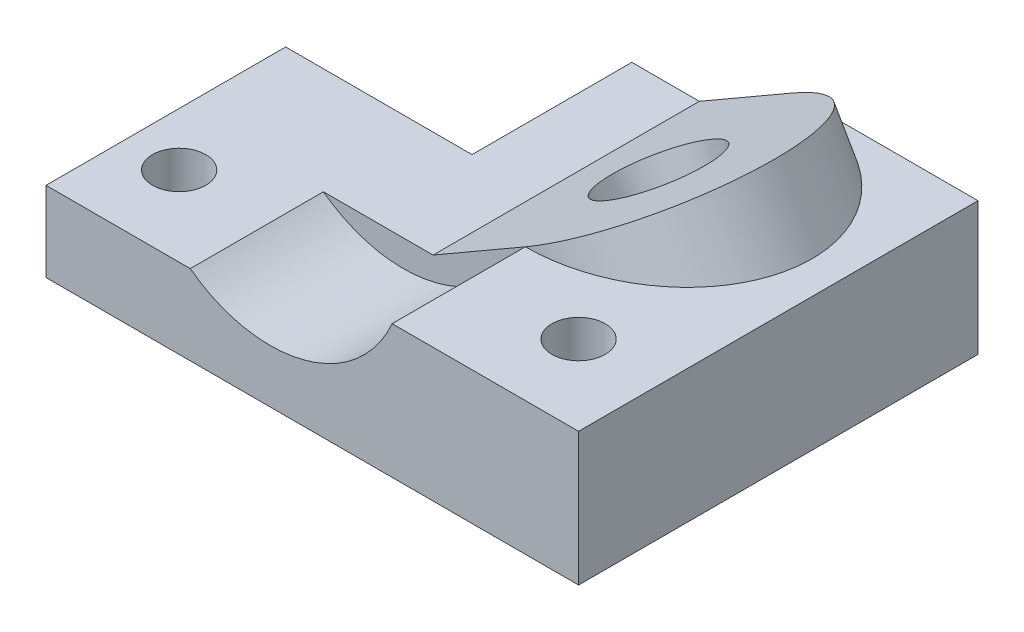
ISO-10303-21;
HEADER;
FILE_DESCRIPTION(('STEP AP214'),'2;1');
FILE_NAME('part.step','',(''),(''),'','','');
FILE_SCHEMA(('AUTOMOTIVE_DESIGN { 1 0 10303 214 1 1 1 1 }'));
ENDSEC;
DATA;
#1=APPLICATION_CONTEXT('core data for automotive mechanical design processes');
#2=APPLICATION_PROTOCOL_DEFINITION('international standard','automotive_design',2000,#1);
#3=PRODUCT_CONTEXT('',#1,'mechanical');
#4=PRODUCT('Part','Part','',(#3));
#5=PRODUCT_RELATED_PRODUCT_CATEGORY('part','',(#4));
#6=PRODUCT_DEFINITION_FORMATION('','',#4);
#7=PRODUCT_DEFINITION_CONTEXT('part definition',#1,'design');
#8=PRODUCT_DEFINITION('design','',#6,#7);
#9=PRODUCT_DEFINITION_SHAPE('','',#8);
#10=(LENGTH_UNIT() NAMED_UNIT(*) SI_UNIT(.MILLI.,.METRE.));
#11=(NAMED_UNIT(*) PLANE_ANGLE_UNIT() SI_UNIT($,.RADIAN.));
#12=(NAMED_UNIT(*) SI_UNIT($,.STERADIAN.) SOLID_ANGLE_UNIT());
#13=UNCERTAINTY_MEASURE_WITH_UNIT(LENGTH_MEASURE(1.E-05),#10,'distance_accuracy_value','');
#14=(GEOMETRIC_REPRESENTATION_CONTEXT(3) GLOBAL_UNCERTAINTY_ASSIGNED_CONTEXT((#13)) GLOBAL_UNIT_ASSIGNED_CONTEXT((#10,
#11,#12)) REPRESENTATION_CONTEXT('',''));
#15=CARTESIAN_POINT('',(0.,0.,0.));
#16=DIRECTION('',(0.,0.,1.));
#17=DIRECTION('',(1.,0.,0.));
#18=AXIS2_PLACEMENT_3D('',#15,#16,#17);
#19=CARTESIAN_POINT('',(0.,15.,0.));
#20=DIRECTION('',(0.,1.,0.));
#21=DIRECTION('',(0.,0.,1.));
#22=AXIS2_PLACEMENT_3D('',#19,#20,#21);
#23=PLANE('',#22);
#24=CARTESIAN_POINT('',(-90.,15.,-15.));
#25=DIRECTION('',(0.,1.,0.));
#26=DIRECTION('',(0.,0.,1.));
#27=AXIS2_PLACEMENT_3D('',#24,#25,#26);
#28=CIRCLE('',#27,5.);
#29=CARTESIAN_POINT('',(-90.,15.,-9.99999999999999));
#30=VERTEX_POINT('',#29);
#31=EDGE_CURVE('E179',#30,#30,#28,.T.);
#32=ORIENTED_EDGE('',*,*,#31,.F.);
#33=EDGE_LOOP('',(#32));
#34=FACE_BOUND('',#33,.T.);
#35=DIRECTION('',(-1.,0.,0.));
#36=VECTOR('',#35,1.);
#37=CARTESIAN_POINT('',(0.,15.,-25.));
#38=LINE('',#37,#36);
#39=CARTESIAN_POINT('',(-52.3205080756887,15.,-25.));
#40=VERTEX_POINT('',#39);
#41=CARTESIAN_POINT('',(-72.9128784747792,15.,-25.));
#42=VERTEX_POINT('',#41);
#43=EDGE_CURVE('E149',#40,#42,#38,.T.);
#44=ORIENTED_EDGE('',*,*,#43,.F.);
#45=DIRECTION('',(0.,0.,-1.));
#46=VECTOR('',#45,1.);
#47=CARTESIAN_POINT('',(-52.3205080756887,15.,-25.));
#48=LINE('',#47,#46);
#49=CARTESIAN_POINT('',(-52.3205080756887,15.,-75.));
#50=VERTEX_POINT('',#49);
#51=EDGE_CURVE('E62',#40,#50,#48,.T.);
#52=ORIENTED_EDGE('',*,*,#51,.T.);
#53=DIRECTION('',(-1.,0.,0.));
#54=VECTOR('',#53,1.);
#55=CARTESIAN_POINT('',(0.,15.,-75.));
#56=LINE('',#55,#54);
#57=CARTESIAN_POINT('',(-65.,15.,-75.));
#58=VERTEX_POINT('',#57);
#59=EDGE_CURVE('E194',#50,#58,#56,.T.);
#60=ORIENTED_EDGE('',*,*,#59,.T.);
#61=DIRECTION('',(0.,0.,1.));
#62=VECTOR('',#61,1.);
#63=CARTESIAN_POINT('',(-65.,15.,0.));
#64=LINE('',#63,#62);
#65=CARTESIAN_POINT('',(-65.,15.,-45.));
#66=VERTEX_POINT('',#65);
#67=EDGE_CURVE('E197',#58,#66,#64,.T.);
#68=ORIENTED_EDGE('',*,*,#67,.T.);
#69=DIRECTION('',(-1.,0.,0.));
#70=VECTOR('',#69,1.);
#71=CARTESIAN_POINT('',(0.,15.,-45.));
#72=LINE('',#71,#70);
#73=CARTESIAN_POINT('',(-100.,15.,-45.));
#74=VERTEX_POINT('',#73);
#75=EDGE_CURVE('E201',#66,#74,#72,.T.);
#76=ORIENTED_EDGE('',*,*,#75,.T.);
#77=DIRECTION('',(0.,0.,-1.));
#78=VECTOR('',#77,1.);
#79=CARTESIAN_POINT('',(-100.,15.,0.));
#80=LINE('',#79,#78);
#81=CARTESIAN_POINT('',(-100.,15.,0.));
#82=VERTEX_POINT('',#81);
#83=EDGE_CURVE('E204',#82,#74,#80,.T.);
#84=ORIENTED_EDGE('',*,*,#83,.F.);
#85=DIRECTION('',(-1.,0.,0.));
#86=VECTOR('',#85,1.);
#87=CARTESIAN_POINT('',(0.,15.,0.));
#88=LINE('',#87,#86);
#89=CARTESIAN_POINT('',(-72.9128784747792,15.,0.));
#90=VERTEX_POINT('',#89);
#91=EDGE_CURVE('E208',#90,#82,#88,.T.);
#92=ORIENTED_EDGE('',*,*,#91,.F.);
#93=DIRECTION('',(0.,0.,1.));
#94=VECTOR('',#93,1.);
#95=CARTESIAN_POINT('',(-72.9128784747792,15.,-25.));
#96=LINE('',#95,#94);
#97=EDGE_CURVE('E188',#42,#90,#96,.T.);
#98=ORIENTED_EDGE('',*,*,#97,.F.);
#99=EDGE_LOOP('',(#44,#52,#60,#68,#76,#84,#92,#98));
#100=FACE_BOUND('',#99,.T.);
#101=ADVANCED_FACE('F45',(#34,#100),#23,.T.);
#102=CARTESIAN_POINT('',(0.,25.,0.));
#103=DIRECTION('',(0.,0.,1.));
#104=DIRECTION('',(1.,0.,0.));
#105=AXIS2_PLACEMENT_3D('',#102,#103,#104);
#106=PLANE('',#105);
#107=DIRECTION('',(-1.,0.,0.));
#108=VECTOR('',#107,1.);
#109=CARTESIAN_POINT('',(0.,25.,0.));
#110=LINE('',#109,#108);
#111=CARTESIAN_POINT('',(0.,25.,0.));
#112=VERTEX_POINT('',#111);
#113=CARTESIAN_POINT('',(-35.,25.,0.));
#114=VERTEX_POINT('',#113);
#115=EDGE_CURVE('E238',#112,#114,#110,.T.);
#116=ORIENTED_EDGE('',*,*,#115,.T.);
#117=CARTESIAN_POINT('',(-57.9128784747792,35.,0.));
#118=DIRECTION('',(0.,0.,1.));
#119=DIRECTION('',(1.,0.,0.));
#120=AXIS2_PLACEMENT_3D('',#117,#118,#119);
#121=CIRCLE('',#120,25.);
#122=EDGE_CURVE('E91',#114,#90,#121,.F.);
#123=ORIENTED_EDGE('',*,*,#122,.T.);
#124=ORIENTED_EDGE('',*,*,#91,.T.);
#125=DIRECTION('',(0.,-1.,0.));
#126=VECTOR('',#125,1.);
#127=CARTESIAN_POINT('',(-100.,15.,0.));
#128=LINE('',#127,#126);
#129=CARTESIAN_POINT('',(-100.,0.,0.));
#130=VERTEX_POINT('',#129);
#131=EDGE_CURVE('E211',#82,#130,#128,.T.);
#132=ORIENTED_EDGE('',*,*,#131,.T.);
#133=DIRECTION('',(-1.,0.,0.));
#134=VECTOR('',#133,1.);
#135=CARTESIAN_POINT('',(0.,0.,0.));
#136=LINE('',#135,#134);
#137=CARTESIAN_POINT('',(0.,0.,0.));
#138=VERTEX_POINT('',#137);
#139=EDGE_CURVE('E245',#138,#130,#136,.T.);
#140=ORIENTED_EDGE('',*,*,#139,.F.);
#141=DIRECTION('',(0.,-1.,0.));
#142=VECTOR('',#141,1.);
#143=CARTESIAN_POINT('',(0.,25.,0.));
#144=LINE('',#143,#142);
#145=EDGE_CURVE('E11',#112,#138,#144,.T.);
#146=ORIENTED_EDGE('',*,*,#145,.F.);
#147=EDGE_LOOP('',(#116,#123,#124,#132,#140,#146));
#148=FACE_BOUND('',#147,.T.);
#149=ADVANCED_FACE('F272',(#148),#106,.T.);
#150=CARTESIAN_POINT('',(0.,25.,-75.));
#151=DIRECTION('',(0.,0.,1.));
#152=DIRECTION('',(1.,0.,0.));
#153=AXIS2_PLACEMENT_3D('',#150,#151,#152);
#154=PLANE('',#153);
#155=DIRECTION('',(-1.,0.,0.));
#156=VECTOR('',#155,1.);
#157=CARTESIAN_POINT('',(0.,0.,-75.));
#158=LINE('',#157,#156);
#159=CARTESIAN_POINT('',(0.,0.,-75.));
#160=VERTEX_POINT('',#159);
#161=CARTESIAN_POINT('',(-65.,0.,-75.));
#162=VERTEX_POINT('',#161);
#163=EDGE_CURVE('E235',#160,#162,#158,.T.);
#164=ORIENTED_EDGE('',*,*,#163,.T.);
#165=DIRECTION('',(0.,-1.,0.));
#166=VECTOR('',#165,1.);
#167=CARTESIAN_POINT('',(-65.,15.,-75.));
#168=LINE('',#167,#166);
#169=EDGE_CURVE('E231',#58,#162,#168,.T.);
#170=ORIENTED_EDGE('',*,*,#169,.F.);
#171=ORIENTED_EDGE('',*,*,#59,.F.);
#172=DIRECTION('',(-0.866025403784438,-0.500000000000001,0.));
#173=VECTOR('',#172,1.);
#174=CARTESIAN_POINT('',(-35.,25.,-75.));
#175=LINE('',#174,#173);
#176=CARTESIAN_POINT('',(-35.,25.,-75.));
#177=VERTEX_POINT('',#176);
#178=EDGE_CURVE('E146',#177,#50,#175,.T.);
#179=ORIENTED_EDGE('',*,*,#178,.F.);
#180=DIRECTION('',(-1.,0.,0.));
#181=VECTOR('',#180,1.);
#182=CARTESIAN_POINT('',(0.,25.,-75.));
#183=LINE('',#182,#181);
#184=CARTESIAN_POINT('',(0.,25.,-75.));
#185=VERTEX_POINT('',#184);
#186=EDGE_CURVE('E157',#185,#177,#183,.T.);
#187=ORIENTED_EDGE('',*,*,#186,.F.);
#188=DIRECTION('',(0.,-1.,0.));
#189=VECTOR('',#188,1.);
#190=CARTESIAN_POINT('',(0.,25.,-75.));
#191=LINE('',#190,#189);
#192=EDGE_CURVE('E55',#185,#160,#191,.T.);
#193=ORIENTED_EDGE('',*,*,#192,.T.);
#194=EDGE_LOOP('',(#164,#170,#171,#179,#187,#193));
#195=FACE_BOUND('',#194,.T.);
#196=ADVANCED_FACE('F47',(#195),#154,.F.);
#197=CARTESIAN_POINT('',(0.,25.,0.));
#198=DIRECTION('',(-1.,0.,0.));
#199=DIRECTION('',(0.,0.,1.));
#200=AXIS2_PLACEMENT_3D('',#197,#198,#199);
#201=PLANE('',#200);
#202=DIRECTION('',(0.,0.,-1.));
#203=VECTOR('',#202,1.);
#204=CARTESIAN_POINT('',(0.,0.,0.));
#205=LINE('',#204,#203);
#206=EDGE_CURVE('E84',#138,#160,#205,.T.);
#207=ORIENTED_EDGE('',*,*,#206,.T.);
#208=ORIENTED_EDGE('',*,*,#192,.F.);
#209=DIRECTION('',(0.,0.,-1.));
#210=VECTOR('',#209,1.);
#211=CARTESIAN_POINT('',(0.,25.,0.));
#212=LINE('',#211,#210);
#213=EDGE_CURVE('E71',#112,#185,#212,.T.);
#214=ORIENTED_EDGE('',*,*,#213,.F.);
#215=ORIENTED_EDGE('',*,*,#145,.T.);
#216=EDGE_LOOP('',(#207,#208,#214,#215));
#217=FACE_BOUND('',#216,.T.);
#218=ADVANCED_FACE('F274',(#217),#201,.F.);
#219=CARTESIAN_POINT('',(0.,25.,0.));
#220=DIRECTION('',(0.,1.,0.));
#221=DIRECTION('',(0.,0.,1.));
#222=AXIS2_PLACEMENT_3D('',#219,#220,#221);
#223=PLANE('',#222);
#224=CARTESIAN_POINT('',(-35.,25.,-50.));
#225=DIRECTION('',(0.,1.,0.));
#226=DIRECTION('',(-1.,0.,0.));
#227=AXIS2_PLACEMENT_3D('',#224,#225,#226);
#228=ELLIPSE('',#227,28.8675134594813,25.);
#229=CARTESIAN_POINT('',(-35.,25.,-25.));
#230=VERTEX_POINT('',#229);
#231=EDGE_CURVE('E153',#177,#230,#228,.F.);
#232=ORIENTED_EDGE('',*,*,#231,.T.);
#233=DIRECTION('',(0.,0.,1.));
#234=VECTOR('',#233,1.);
#235=CARTESIAN_POINT('',(-35.,25.,-25.));
#236=LINE('',#235,#234);
#237=EDGE_CURVE('E129',#230,#114,#236,.T.);
#238=ORIENTED_EDGE('',*,*,#237,.T.);
#239=ORIENTED_EDGE('',*,*,#115,.F.);
#240=ORIENTED_EDGE('',*,*,#213,.T.);
#241=ORIENTED_EDGE('',*,*,#186,.T.);
#242=EDGE_LOOP('',(#232,#238,#239,#240,#241));
#243=FACE_BOUND('',#242,.T.);
#244=CARTESIAN_POINT('',(-15.,25.,-15.));
#245=DIRECTION('',(0.,1.,0.));
#246=DIRECTION('',(0.,0.,1.));
#247=AXIS2_PLACEMENT_3D('',#244,#245,#246);
#248=CIRCLE('',#247,5.);
#249=CARTESIAN_POINT('',(-15.,25.,-10.));
#250=VERTEX_POINT('',#249);
#251=EDGE_CURVE('E174',#250,#250,#248,.T.);
#252=ORIENTED_EDGE('',*,*,#251,.F.);
#253=EDGE_LOOP('',(#252));
#254=FACE_BOUND('',#253,.T.);
#255=ADVANCED_FACE('F154',(#243,#254),#223,.T.);
#256=CARTESIAN_POINT('',(0.,0.,0.));
#257=DIRECTION('',(0.,1.,0.));
#258=DIRECTION('',(0.,0.,1.));
#259=AXIS2_PLACEMENT_3D('',#256,#257,#258);
#260=PLANE('',#259);
#261=CARTESIAN_POINT('',(-20.5662432702593,0.,-50.));
#262=DIRECTION('',(0.,1.,0.));
#263=DIRECTION('',(-1.,0.,0.));
#264=AXIS2_PLACEMENT_3D('',#261,#262,#263);
#265=ELLIPSE('',#264,11.5470053837925,10.);
#266=CARTESIAN_POINT('',(-32.1132486540518,0.,-50.));
#267=VERTEX_POINT('',#266);
#268=EDGE_CURVE('E163',#267,#267,#265,.T.);
#269=ORIENTED_EDGE('',*,*,#268,.T.);
#270=EDGE_LOOP('',(#269));
#271=FACE_BOUND('',#270,.T.);
#272=CARTESIAN_POINT('',(-15.,0.,-15.));
#273=DIRECTION('',(0.,1.,0.));
#274=DIRECTION('',(0.,0.,1.));
#275=AXIS2_PLACEMENT_3D('',#272,#273,#274);
#276=CIRCLE('',#275,5.);
#277=CARTESIAN_POINT('',(-15.,0.,-10.));
#278=VERTEX_POINT('',#277);
#279=EDGE_CURVE('E175',#278,#278,#276,.T.);
#280=ORIENTED_EDGE('',*,*,#279,.T.);
#281=EDGE_LOOP('',(#280));
#282=FACE_BOUND('',#281,.T.);
#283=CARTESIAN_POINT('',(-90.,0.,-15.));
#284=DIRECTION('',(0.,1.,0.));
#285=DIRECTION('',(0.,0.,1.));
#286=AXIS2_PLACEMENT_3D('',#283,#284,#285);
#287=CIRCLE('',#286,5.);
#288=CARTESIAN_POINT('',(-90.,0.,-9.99999999999999));
#289=VERTEX_POINT('',#288);
#290=EDGE_CURVE('E49',#289,#289,#287,.T.);
#291=ORIENTED_EDGE('',*,*,#290,.T.);
#292=EDGE_LOOP('',(#291));
#293=FACE_BOUND('',#292,.T.);
#294=ORIENTED_EDGE('',*,*,#163,.F.);
#295=ORIENTED_EDGE('',*,*,#206,.F.);
#296=ORIENTED_EDGE('',*,*,#139,.T.);
#297=DIRECTION('',(0.,0.,-1.));
#298=VECTOR('',#297,1.);
#299=CARTESIAN_POINT('',(-100.,0.,0.));
#300=LINE('',#299,#298);
#301=CARTESIAN_POINT('',(-100.,0.,-45.));
#302=VERTEX_POINT('',#301);
#303=EDGE_CURVE('E198',#130,#302,#300,.T.);
#304=ORIENTED_EDGE('',*,*,#303,.T.);
#305=DIRECTION('',(-1.,0.,0.));
#306=VECTOR('',#305,1.);
#307=CARTESIAN_POINT('',(0.,0.,-45.));
#308=LINE('',#307,#306);
#309=CARTESIAN_POINT('',(-65.,0.,-45.));
#310=VERTEX_POINT('',#309);
#311=EDGE_CURVE('E214',#310,#302,#308,.T.);
#312=ORIENTED_EDGE('',*,*,#311,.F.);
#313=DIRECTION('',(0.,0.,1.));
#314=VECTOR('',#313,1.);
#315=CARTESIAN_POINT('',(-65.,0.,0.));
#316=LINE('',#315,#314);
#317=EDGE_CURVE('E193',#162,#310,#316,.T.);
#318=ORIENTED_EDGE('',*,*,#317,.F.);
#319=EDGE_LOOP('',(#294,#295,#296,#304,#312,#318));
#320=FACE_BOUND('',#319,.T.);
#321=ADVANCED_FACE('F256',(#271,#282,#293,#320),#260,.F.);
#322=CARTESIAN_POINT('',(-65.,15.,0.));
#323=DIRECTION('',(1.,0.,0.));
#324=DIRECTION('',(0.,0.,-1.));
#325=AXIS2_PLACEMENT_3D('',#322,#323,#324);
#326=PLANE('',#325);
#327=ORIENTED_EDGE('',*,*,#317,.T.);
#328=DIRECTION('',(0.,-1.,0.));
#329=VECTOR('',#328,1.);
#330=CARTESIAN_POINT('',(-65.,15.,-45.));
#331=LINE('',#330,#329);
#332=EDGE_CURVE('E227',#66,#310,#331,.T.);
#333=ORIENTED_EDGE('',*,*,#332,.F.);
#334=ORIENTED_EDGE('',*,*,#67,.F.);
#335=ORIENTED_EDGE('',*,*,#169,.T.);
#336=EDGE_LOOP('',(#327,#333,#334,#335));
#337=FACE_BOUND('',#336,.T.);
#338=ADVANCED_FACE('F261',(#337),#326,.F.);
#339=CARTESIAN_POINT('',(0.,15.,-45.));
#340=DIRECTION('',(0.,0.,1.));
#341=DIRECTION('',(1.,0.,0.));
#342=AXIS2_PLACEMENT_3D('',#339,#340,#341);
#343=PLANE('',#342);
#344=ORIENTED_EDGE('',*,*,#311,.T.);
#345=DIRECTION('',(0.,-1.,0.));
#346=VECTOR('',#345,1.);
#347=CARTESIAN_POINT('',(-100.,15.,-45.));
#348=LINE('',#347,#346);
#349=EDGE_CURVE('E224',#74,#302,#348,.T.);
#350=ORIENTED_EDGE('',*,*,#349,.F.);
#351=ORIENTED_EDGE('',*,*,#75,.F.);
#352=ORIENTED_EDGE('',*,*,#332,.T.);
#353=EDGE_LOOP('',(#344,#350,#351,#352));
#354=FACE_BOUND('',#353,.T.);
#355=ADVANCED_FACE('F265',(#354),#343,.F.);
#356=CARTESIAN_POINT('',(-100.,15.,0.));
#357=DIRECTION('',(-1.,0.,0.));
#358=DIRECTION('',(0.,0.,1.));
#359=AXIS2_PLACEMENT_3D('',#356,#357,#358);
#360=PLANE('',#359);
#361=ORIENTED_EDGE('',*,*,#303,.F.);
#362=ORIENTED_EDGE('',*,*,#131,.F.);
#363=ORIENTED_EDGE('',*,*,#83,.T.);
#364=ORIENTED_EDGE('',*,*,#349,.T.);
#365=EDGE_LOOP('',(#361,#362,#363,#364));
#366=FACE_BOUND('',#365,.T.);
#367=ADVANCED_FACE('F293',(#366),#360,.T.);
#368=CARTESIAN_POINT('',(-57.9128784747792,35.,-25.));
#369=DIRECTION('',(0.,0.,1.));
#370=DIRECTION('',(1.,0.,0.));
#371=AXIS2_PLACEMENT_3D('',#368,#369,#370);
#372=CYLINDRICAL_SURFACE('',#371,25.);
#373=ORIENTED_EDGE('',*,*,#122,.F.);
#374=ORIENTED_EDGE('',*,*,#237,.F.);
#375=CARTESIAN_POINT('',(-57.9128784747792,35.,-25.));
#376=DIRECTION('',(0.,0.,1.));
#377=DIRECTION('',(1.,0.,0.));
#378=AXIS2_PLACEMENT_3D('',#375,#376,#377);
#379=CIRCLE('',#378,25.);
#380=EDGE_CURVE('E132',#230,#42,#379,.F.);
#381=ORIENTED_EDGE('',*,*,#380,.T.);
#382=ORIENTED_EDGE('',*,*,#97,.T.);
#383=EDGE_LOOP('',(#373,#374,#381,#382));
#384=FACE_BOUND('',#383,.T.);
#385=ADVANCED_FACE('F130',(#384),#372,.F.);
#386=CARTESIAN_POINT('',(0.,0.,-25.));
#387=DIRECTION('',(0.,0.,1.));
#388=DIRECTION('',(1.,0.,0.));
#389=AXIS2_PLACEMENT_3D('',#386,#387,#388);
#390=PLANE('',#389);
#391=ORIENTED_EDGE('',*,*,#380,.F.);
#392=DIRECTION('',(-0.866025403784438,-0.500000000000001,0.));
#393=VECTOR('',#392,1.);
#394=CARTESIAN_POINT('',(-35.,25.,-25.));
#395=LINE('',#394,#393);
#396=EDGE_CURVE('E139',#230,#40,#395,.T.);
#397=ORIENTED_EDGE('',*,*,#396,.T.);
#398=ORIENTED_EDGE('',*,*,#43,.T.);
#399=EDGE_LOOP('',(#391,#397,#398));
#400=FACE_BOUND('',#399,.T.);
#401=ADVANCED_FACE('F148',(#400),#390,.T.);
#402=CARTESIAN_POINT('',(-90.,-10.,-15.));
#403=DIRECTION('',(0.,1.,0.));
#404=DIRECTION('',(0.,0.,1.));
#405=AXIS2_PLACEMENT_3D('',#402,#403,#404);
#406=CYLINDRICAL_SURFACE('',#405,5.);
#407=ORIENTED_EDGE('',*,*,#31,.T.);
#408=EDGE_LOOP('',(#407));
#409=FACE_BOUND('',#408,.T.);
#410=ORIENTED_EDGE('',*,*,#290,.F.);
#411=EDGE_LOOP('',(#410));
#412=FACE_BOUND('',#411,.T.);
#413=ADVANCED_FACE('F312',(#409,#412),#406,.F.);
#414=CARTESIAN_POINT('',(-15.,0.,-15.));
#415=DIRECTION('',(0.,1.,0.));
#416=DIRECTION('',(0.,0.,1.));
#417=AXIS2_PLACEMENT_3D('',#414,#415,#416);
#418=CYLINDRICAL_SURFACE('',#417,5.);
#419=ORIENTED_EDGE('',*,*,#279,.F.);
#420=EDGE_LOOP('',(#419));
#421=FACE_BOUND('',#420,.T.);
#422=ORIENTED_EDGE('',*,*,#251,.T.);
#423=EDGE_LOOP('',(#422));
#424=FACE_BOUND('',#423,.T.);
#425=ADVANCED_FACE('F314',(#421,#424),#418,.F.);
#426=CARTESIAN_POINT('',(-35.,25.,-25.));
#427=DIRECTION('',(0.500000000000001,-0.866025403784438,0.));
#428=DIRECTION('',(0.866025403784438,0.500000000000001,0.));
#429=AXIS2_PLACEMENT_3D('',#426,#427,#428);
#430=PLANE('',#429);
#431=CARTESIAN_POINT('',(-35.,25.,-50.));
#432=DIRECTION('',(-0.500000000000001,0.866025403784438,0.));
#433=DIRECTION('',(-0.866025403784438,-0.500000000000001,0.));
#434=AXIS2_PLACEMENT_3D('',#431,#432,#433);
#435=CIRCLE('',#434,10.);
#436=CARTESIAN_POINT('',(-43.6602540378444,20.,-50.));
#437=VERTEX_POINT('',#436);
#438=EDGE_CURVE('E167',#437,#437,#435,.T.);
#439=ORIENTED_EDGE('',*,*,#438,.F.);
#440=EDGE_LOOP('',(#439));
#441=FACE_BOUND('',#440,.T.);
#442=ORIENTED_EDGE('',*,*,#178,.T.);
#443=ORIENTED_EDGE('',*,*,#51,.F.);
#444=ORIENTED_EDGE('',*,*,#396,.F.);
#445=CARTESIAN_POINT('',(-35.,25.,-50.));
#446=DIRECTION('',(-0.500000000000001,0.866025403784438,0.));
#447=DIRECTION('',(-0.866025403784438,-0.500000000000001,0.));
#448=AXIS2_PLACEMENT_3D('',#445,#446,#447);
#449=CIRCLE('',#448,25.);
#450=EDGE_CURVE('E142',#230,#177,#449,.T.);
#451=ORIENTED_EDGE('',*,*,#450,.T.);
#452=EDGE_LOOP('',(#442,#443,#444,#451));
#453=FACE_BOUND('',#452,.T.);
#454=ADVANCED_FACE('F140',(#441,#453),#430,.F.);
#455=CARTESIAN_POINT('',(-1.27870534899346,-33.4069956325437,-50.));
#456=DIRECTION('',(-0.500000000000001,0.866025403784438,0.));
#457=DIRECTION('',(-0.866025403784438,-0.500000000000001,0.));
#458=AXIS2_PLACEMENT_3D('',#455,#456,#457);
#459=CYLINDRICAL_SURFACE('',#458,25.);
#460=ORIENTED_EDGE('',*,*,#231,.F.);
#461=ORIENTED_EDGE('',*,*,#450,.F.);
#462=EDGE_LOOP('',(#460,#461));
#463=FACE_BOUND('',#462,.T.);
#464=ADVANCED_FACE('F161',(#463),#459,.T.);
#465=CARTESIAN_POINT('',(-15.4246824526945,-8.90544456622767,-50.));
#466=DIRECTION('',(-0.500000000000001,0.866025403784438,0.));
#467=DIRECTION('',(-0.866025403784438,-0.500000000000001,0.));
#468=AXIS2_PLACEMENT_3D('',#465,#466,#467);
#469=CYLINDRICAL_SURFACE('',#468,10.);
#470=ORIENTED_EDGE('',*,*,#438,.T.);
#471=EDGE_LOOP('',(#470));
#472=FACE_BOUND('',#471,.T.);
#473=ORIENTED_EDGE('',*,*,#268,.F.);
#474=EDGE_LOOP('',(#473));
#475=FACE_BOUND('',#474,.T.);
#476=ADVANCED_FACE('F329',(#472,#475),#469,.F.);
#477=CLOSED_SHELL('',(#101,#149,#196,#218,#255,#321,#338,#355,#367,#385,#401,#413,#425,#454,
#464,#476));
#478=MANIFOLD_SOLID_BREP('B2',#477);
#479=ADVANCED_BREP_SHAPE_REPRESENTATION('',(#18,#478),#14);
#480=SHAPE_DEFINITION_REPRESENTATION(#9,#479);
ENDSEC;
END-ISO-10303-21;
